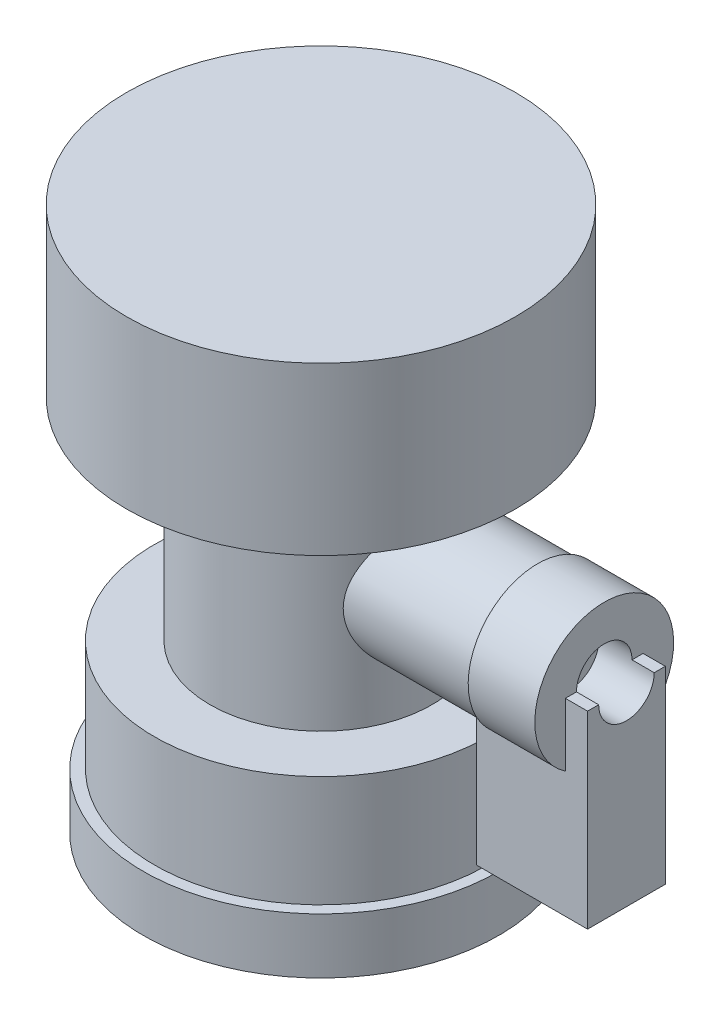
ISO-10303-21;
HEADER;
FILE_DESCRIPTION(('STEP AP214'),'2;1');
FILE_NAME('part.step','',(''),(''),'','','');
FILE_SCHEMA(('AUTOMOTIVE_DESIGN { 1 0 10303 214 1 1 1 1 }'));
ENDSEC;
DATA;
#1=APPLICATION_CONTEXT('core data for automotive mechanical design processes');
#2=APPLICATION_PROTOCOL_DEFINITION('international standard','automotive_design',2000,#1);
#3=PRODUCT_CONTEXT('',#1,'mechanical');
#4=PRODUCT('Part','Part','',(#3));
#5=PRODUCT_RELATED_PRODUCT_CATEGORY('part','',(#4));
#6=PRODUCT_DEFINITION_FORMATION('','',#4);
#7=PRODUCT_DEFINITION_CONTEXT('part definition',#1,'design');
#8=PRODUCT_DEFINITION('design','',#6,#7);
#9=PRODUCT_DEFINITION_SHAPE('','',#8);
#10=(LENGTH_UNIT() NAMED_UNIT(*) SI_UNIT(.MILLI.,.METRE.));
#11=(NAMED_UNIT(*) PLANE_ANGLE_UNIT() SI_UNIT($,.RADIAN.));
#12=(NAMED_UNIT(*) SI_UNIT($,.STERADIAN.) SOLID_ANGLE_UNIT());
#13=UNCERTAINTY_MEASURE_WITH_UNIT(LENGTH_MEASURE(1.E-05),#10,'distance_accuracy_value','');
#14=(GEOMETRIC_REPRESENTATION_CONTEXT(3) GLOBAL_UNCERTAINTY_ASSIGNED_CONTEXT((#13)) GLOBAL_UNIT_ASSIGNED_CONTEXT((#10,
#11,#12)) REPRESENTATION_CONTEXT('',''));
#15=CARTESIAN_POINT('',(0.,0.,0.));
#16=DIRECTION('',(0.,0.,1.));
#17=DIRECTION('',(1.,0.,0.));
#18=AXIS2_PLACEMENT_3D('',#15,#16,#17);
#19=CARTESIAN_POINT('',(0.,10.,0.));
#20=DIRECTION('',(0.,1.,0.));
#21=DIRECTION('',(0.,0.,1.));
#22=AXIS2_PLACEMENT_3D('',#19,#20,#21);
#23=PLANE('',#22);
#24=DIRECTION('',(0.,0.,1.));
#25=VECTOR('',#24,1.);
#26=CARTESIAN_POINT('',(25.5,10.,0.));
#27=LINE('',#26,#25);
#28=CARTESIAN_POINT('',(25.5,10.,-3.5));
#29=VERTEX_POINT('',#28);
#30=CARTESIAN_POINT('',(25.5,10.,-2.5));
#31=VERTEX_POINT('',#30);
#32=EDGE_CURVE('E44',#29,#31,#27,.T.);
#33=ORIENTED_EDGE('',*,*,#32,.T.);
#34=DIRECTION('',(-1.,0.,0.));
#35=VECTOR('',#34,1.);
#36=CARTESIAN_POINT('',(27.501,10.,-2.5));
#37=LINE('',#36,#35);
#38=CARTESIAN_POINT('',(27.5,10.,-2.5));
#39=VERTEX_POINT('',#38);
#40=EDGE_CURVE('E113',#39,#31,#37,.T.);
#41=ORIENTED_EDGE('',*,*,#40,.F.);
#42=DIRECTION('',(0.,0.,-1.));
#43=VECTOR('',#42,1.);
#44=CARTESIAN_POINT('',(27.5,10.,-3.5));
#45=LINE('',#44,#43);
#46=CARTESIAN_POINT('',(27.5,10.,-3.5));
#47=VERTEX_POINT('',#46);
#48=EDGE_CURVE('E232',#39,#47,#45,.T.);
#49=ORIENTED_EDGE('',*,*,#48,.T.);
#50=DIRECTION('',(-1.,0.,0.));
#51=VECTOR('',#50,1.);
#52=CARTESIAN_POINT('',(17.5,10.,-3.5));
#53=LINE('',#52,#51);
#54=EDGE_CURVE('E133',#47,#29,#53,.T.);
#55=ORIENTED_EDGE('',*,*,#54,.T.);
#56=EDGE_LOOP('',(#33,#41,#49,#55));
#57=FACE_BOUND('',#56,.T.);
#58=ADVANCED_FACE('F33',(#57),#23,.T.);
#59=CARTESIAN_POINT('',(27.5,10.,3.5));
#60=VERTEX_POINT('',#59);
#61=CARTESIAN_POINT('',(27.5,10.,2.5));
#62=VERTEX_POINT('',#61);
#63=EDGE_CURVE('E238',#60,#62,#45,.T.);
#64=ORIENTED_EDGE('',*,*,#63,.T.);
#65=DIRECTION('',(-1.,0.,0.));
#66=VECTOR('',#65,1.);
#67=CARTESIAN_POINT('',(27.501,10.,2.5));
#68=LINE('',#67,#66);
#69=CARTESIAN_POINT('',(25.5,10.,2.5));
#70=VERTEX_POINT('',#69);
#71=EDGE_CURVE('E121',#70,#62,#68,.F.);
#72=ORIENTED_EDGE('',*,*,#71,.F.);
#73=CARTESIAN_POINT('',(25.5,10.,3.5));
#74=VERTEX_POINT('',#73);
#75=EDGE_CURVE('E38',#70,#74,#27,.T.);
#76=ORIENTED_EDGE('',*,*,#75,.T.);
#77=DIRECTION('',(1.,0.,0.));
#78=VECTOR('',#77,1.);
#79=CARTESIAN_POINT('',(17.5,10.,3.5));
#80=LINE('',#79,#78);
#81=EDGE_CURVE('E242',#74,#60,#80,.T.);
#82=ORIENTED_EDGE('',*,*,#81,.T.);
#83=EDGE_LOOP('',(#64,#72,#76,#82));
#84=FACE_BOUND('',#83,.T.);
#85=ADVANCED_FACE('F217',(#84),#23,.T.);
#86=CARTESIAN_POINT('',(0.,19.,0.));
#87=DIRECTION('',(0.,-1.,0.));
#88=DIRECTION('',(0.,0.,-1.));
#89=AXIS2_PLACEMENT_3D('',#86,#87,#88);
#90=CYLINDRICAL_SURFACE('',#89,10.);
#91=CARTESIAN_POINT('',(0.,19.,0.));
#92=DIRECTION('',(0.,1.,0.));
#93=DIRECTION('',(0.,0.,1.));
#94=AXIS2_PLACEMENT_3D('',#91,#92,#93);
#95=CIRCLE('',#94,10.);
#96=CARTESIAN_POINT('',(0.,19.,10.));
#97=VERTEX_POINT('',#96);
#98=EDGE_CURVE('E147',#97,#97,#95,.T.);
#99=ORIENTED_EDGE('',*,*,#98,.F.);
#100=EDGE_LOOP('',(#99));
#101=FACE_BOUND('',#100,.T.);
#102=CARTESIAN_POINT('',(0.,0.,0.));
#103=DIRECTION('',(0.,-1.,0.));
#104=DIRECTION('',(0.,0.,-1.));
#105=AXIS2_PLACEMENT_3D('',#102,#103,#104);
#106=CIRCLE('',#105,10.);
#107=CARTESIAN_POINT('',(0.,0.,-10.));
#108=VERTEX_POINT('',#107);
#109=EDGE_CURVE('E303',#108,#108,#106,.T.);
#110=ORIENTED_EDGE('',*,*,#109,.F.);
#111=EDGE_LOOP('',(#110));
#112=FACE_BOUND('',#111,.T.);
#113=CARTESIAN_POINT('',(8.,9.5,6.));
#114=CARTESIAN_POINT('',(7.99999864910224,9.34904564342539,6.00000088162881));
#115=CARTESIAN_POINT('',(8.00428833679091,9.19810168544327,5.99429471853482));
#116=CARTESIAN_POINT('',(8.02124863219104,8.89755593604797,5.97158029595807));
#117=CARTESIAN_POINT('',(8.03391868193524,8.74795405595088,5.95457278892218));
#118=CARTESIAN_POINT('',(8.06710734950176,8.45120189824819,5.90953108490972));
#119=CARTESIAN_POINT('',(8.08763148624475,8.30405342065063,5.88148913384211));
#120=CARTESIAN_POINT('',(8.13569970975774,8.01332190872561,5.81481476566768));
#121=CARTESIAN_POINT('',(8.16324712098121,7.86974059833025,5.77617733255313));
#122=CARTESIAN_POINT('',(8.25448068613034,7.44786055186919,5.64577521853615));
#123=CARTESIAN_POINT('',(8.32706572533657,7.17593079687085,5.53912991890453));
#124=CARTESIAN_POINT('',(8.48743711552897,6.65420402243849,5.29011262993967));
#125=CARTESIAN_POINT('',(8.57522799841511,6.4044136349968,5.1477299838664));
#126=CARTESIAN_POINT('',(8.76915411563735,5.90019208918971,4.81082834240806));
#127=CARTESIAN_POINT('',(8.87621984994956,5.64892775550919,4.61206328098179));
#128=CARTESIAN_POINT('',(9.03582231230531,5.29798768522199,4.28586871155472));
#129=CARTESIAN_POINT('',(9.08889374486005,5.18526425100264,4.17237380323688));
#130=CARTESIAN_POINT('',(9.19358587409139,4.96888581697478,3.93632146632463));
#131=CARTESIAN_POINT('',(9.24520630192437,4.86523249026502,3.81376237338527));
#132=CARTESIAN_POINT('',(9.35129695987745,4.65689755465558,3.54628422867016));
#133=CARTESIAN_POINT('',(9.40546909597467,4.55332360503964,3.40038171956539));
#134=CARTESIAN_POINT('',(9.50910263041578,4.3590094895466,3.09877025729808));
#135=CARTESIAN_POINT('',(9.55856613020448,4.26826358971097,2.94306573077009));
#136=CARTESIAN_POINT('',(9.65137615734108,4.10056137168402,2.62273316271579));
#137=CARTESIAN_POINT('',(9.69472531078955,4.02359912958213,2.45810899446899));
#138=CARTESIAN_POINT('',(9.77400834963342,3.88444025294899,2.12101861519267));
#139=CARTESIAN_POINT('',(9.80994345348834,3.82224119191448,1.94855369844294));
#140=CARTESIAN_POINT('',(9.87021533870989,3.71875934967134,1.61397887310178));
#141=CARTESIAN_POINT('',(9.89533161968247,3.67604710392526,1.45245106417626));
#142=CARTESIAN_POINT('',(9.9378378885394,3.60411446964764,1.12541380029543));
#143=CARTESIAN_POINT('',(9.95522832436573,3.57489329890412,0.95990457676792));
#144=CARTESIAN_POINT('',(9.98175593635162,3.53042968235231,0.626493434249518));
#145=CARTESIAN_POINT('',(9.99089957459115,3.51517629143543,0.4585934935768));
#146=CARTESIAN_POINT('',(10.0006753626941,3.49887074383716,0.121864540254611));
#147=CARTESIAN_POINT('',(10.001308378531,3.49781714229768,-0.0469643761207655));
#148=CARTESIAN_POINT('',(9.99450134908414,3.50916786570373,-0.362947404042192));
#149=CARTESIAN_POINT('',(9.988055423997,3.5199149503719,-0.510186129271388));
#150=CARTESIAN_POINT('',(9.96877939171652,3.55216587391558,-0.803109015744185));
#151=CARTESIAN_POINT('',(9.95594720380779,3.57367321861545,-0.948792654511348));
#152=CARTESIAN_POINT('',(9.92419812325367,3.62716671707077,-1.237487698066));
#153=CARTESIAN_POINT('',(9.90528336854382,3.65914918904125,-1.38050002312209));
#154=CARTESIAN_POINT('',(9.86178063907867,3.73323178375653,-1.66304733568859));
#155=CARTESIAN_POINT('',(9.83719047557732,3.77533581018384,-1.80258095855974));
#156=CARTESIAN_POINT('',(9.78271380551187,3.86946079856275,-2.07805771309281));
#157=CARTESIAN_POINT('',(9.75279971061266,3.92153352961879,-2.213977685514));
#158=CARTESIAN_POINT('',(9.68837327507413,4.03495221750533,-2.48078460487242));
#159=CARTESIAN_POINT('',(9.65385929910513,4.09630147333404,-2.61166974042208));
#160=CARTESIAN_POINT('',(9.54441159722313,4.29348383177023,-2.99582005885702));
#161=CARTESIAN_POINT('',(9.46353385850713,4.44251596520929,-3.24076653470714));
#162=CARTESIAN_POINT('',(9.28151313170845,4.79136512865929,-3.73233294691791));
#163=CARTESIAN_POINT('',(9.1791034522392,4.99512190487958,-3.97565808525399));
#164=CARTESIAN_POINT('',(8.97020600808983,5.43764785523005,-4.42687522495971));
#165=CARTESIAN_POINT('',(8.86371287022899,5.67646441811516,-4.63471843137172));
#166=CARTESIAN_POINT('',(8.70226894648173,6.0727205951449,-4.92797850102128));
#167=CARTESIAN_POINT('',(8.64532309391492,6.21952832884375,-5.02692901573439));
#168=CARTESIAN_POINT('',(8.53500632501968,6.52237939462107,-5.21202996714069));
#169=CARTESIAN_POINT('',(8.48163599732456,6.67842423946547,-5.29817829905958));
#170=CARTESIAN_POINT('',(8.38051460035721,6.99878299774766,-5.45672185252633));
#171=CARTESIAN_POINT('',(8.33275515227876,7.16308404440611,-5.52913768295357));
#172=CARTESIAN_POINT('',(8.24479422007601,7.49927336764095,-5.65946619795369));
#173=CARTESIAN_POINT('',(8.20458976848892,7.67115863238163,-5.71738457983655));
#174=CARTESIAN_POINT('',(8.14249128928077,7.97789327470977,-5.80533969433249));
#175=CARTESIAN_POINT('',(8.11852850235761,8.11137106236812,-5.83872912399161));
#176=CARTESIAN_POINT('',(8.07675184174586,8.38121883532171,-5.89638461996681));
#177=CARTESIAN_POINT('',(8.05893661056294,8.51758817503993,-5.92065270055165));
#178=CARTESIAN_POINT('',(8.03008524390666,8.79225672647759,-5.95972506119773));
#179=CARTESIAN_POINT('',(8.01904259918271,8.93055395407736,-5.97453842890673));
#180=CARTESIAN_POINT('',(8.00411818497226,9.20823671755184,-5.99451827965109));
#181=CARTESIAN_POINT('',(8.00023656735144,9.34762227644411,-5.99968455809828));
#182=CARTESIAN_POINT('',(7.9997841667535,9.62661872216614,-6.00028779640298));
#183=CARTESIAN_POINT('',(8.00322344790999,9.76622965520106,-5.99571136282798));
#184=CARTESIAN_POINT('',(8.01729967500599,10.0444250961031,-5.97687561218467));
#185=CARTESIAN_POINT('',(8.02793665843563,10.1830095986202,-5.96261624468159));
#186=CARTESIAN_POINT('',(8.05602115916921,10.4582396449522,-5.92461644085682));
#187=CARTESIAN_POINT('',(8.0734719572314,10.5948842218242,-5.90087143720405));
#188=CARTESIAN_POINT('',(8.11456896902297,10.865333055754,-5.84422673057314));
#189=CARTESIAN_POINT('',(8.13821771175741,10.9991361292184,-5.81132329025206));
#190=CARTESIAN_POINT('',(8.21726148194672,11.3947012270525,-5.6995591577321));
#191=CARTESIAN_POINT('',(8.28082455624298,11.6512538881402,-5.60755471788689));
#192=CARTESIAN_POINT('',(8.42286190152657,12.1459475353118,-5.39184793321014));
#193=CARTESIAN_POINT('',(8.50134179431292,12.3840815320743,-5.26813363152924));
#194=CARTESIAN_POINT('',(8.68148215419451,12.8809727151561,-4.96667794724345));
#195=CARTESIAN_POINT('',(8.78477096130256,13.1357084330293,-4.78321740719474));
#196=CARTESIAN_POINT('',(8.94082079344033,13.4937195359984,-4.48048054495125));
#197=CARTESIAN_POINT('',(8.99306477859641,13.6091219100944,-4.37488391749691));
#198=CARTESIAN_POINT('',(9.09684476254055,13.8315431826378,-4.15478036587187));
#199=CARTESIAN_POINT('',(9.14838063437488,13.9385605935553,-4.04027186784564));
#200=CARTESIAN_POINT('',(9.25623949495886,14.1570525367295,-3.78725916521219));
#201=CARTESIAN_POINT('',(9.31230980002967,14.2672869117514,-3.6475734482155));
#202=CARTESIAN_POINT('',(9.4205941057635,14.4754893222743,-3.35801798035469));
#203=CARTESIAN_POINT('',(9.47280966312088,14.5734623206243,-3.20815238798259));
#204=CARTESIAN_POINT('',(9.57195369339457,14.756252646494,-2.89897367155155));
#205=CARTESIAN_POINT('',(9.61888335615541,14.8410729362886,-2.73966268600567));
#206=CARTESIAN_POINT('',(9.70609419072746,14.996581661781,-2.41254488128161));
#207=CARTESIAN_POINT('',(9.74637626882177,15.067272024128,-2.24473922428781));
#208=CARTESIAN_POINT('',(9.81640309379021,15.1889418509117,-1.91432616994729));
#209=CARTESIAN_POINT('',(9.84670057004255,15.2409798077395,-1.75222599070734));
#210=CARTESIAN_POINT('',(9.89963820465492,15.3313101560026,-1.42300707093318));
#211=CARTESIAN_POINT('',(9.92227864784977,15.369603058745,-1.25588851732988));
#212=CARTESIAN_POINT('',(9.95919887612942,15.4318014566571,-0.918243836101159));
#213=CARTESIAN_POINT('',(9.97348653527641,15.4557205024728,-0.747721074946205));
#214=CARTESIAN_POINT('',(9.99328101588267,15.4888098960502,-0.40475172803911));
#215=CARTESIAN_POINT('',(9.99878898200748,15.497982166446,-0.232305396028008));
#216=CARTESIAN_POINT('',(10.0007158823898,15.5011926694547,0.0897214575485174));
#217=CARTESIAN_POINT('',(9.99825014101708,15.4970879970575,0.239280869884801));
#218=CARTESIAN_POINT('',(9.9866626014441,15.477749677153,0.537418992701509));
#219=CARTESIAN_POINT('',(9.9775409702157,15.462516308824,0.685997727689192));
#220=CARTESIAN_POINT('',(9.952860128368,15.4211231987912,0.981069174103281));
#221=CARTESIAN_POINT('',(9.93730123061827,15.394963988114,1.1275619865536));
#222=CARTESIAN_POINT('',(9.9001089462329,15.3320493795146,1.41746403997302));
#223=CARTESIAN_POINT('',(9.87847537754162,15.2952936640182,1.56087318838717));
#224=CARTESIAN_POINT('',(9.83001294823669,15.2122913284712,1.84140451131591));
#225=CARTESIAN_POINT('',(9.80327452445085,15.1662091862011,1.97859106269807));
#226=CARTESIAN_POINT('',(9.74493680815261,15.0646663940233,2.24839766655467));
#227=CARTESIAN_POINT('',(9.71333594213896,15.0092027076401,2.38101622374934));
#228=CARTESIAN_POINT('',(9.61215652370218,14.8294860441307,2.77099118695356));
#229=CARTESIAN_POINT('',(9.53616574328078,14.6918483176854,3.02066419261719));
#230=CARTESIAN_POINT('',(9.36373418778332,14.368291940321,3.52109065838496));
#231=CARTESIAN_POINT('',(9.26596893066758,14.1787539976608,3.76901891084855));
#232=CARTESIAN_POINT('',(9.06406113204372,13.7649589992621,4.23160593003124));
#233=CARTESIAN_POINT('',(8.95991160370153,13.5406634801235,4.44622730563912));
#234=CARTESIAN_POINT('',(8.79909217120191,13.1659057724075,4.75306699513205));
#235=CARTESIAN_POINT('',(8.74152637033407,13.0259090644312,4.85784420248668));
#236=CARTESIAN_POINT('',(8.6288705170943,12.7365378320188,5.05524371029082));
#237=CARTESIAN_POINT('',(8.57378107511544,12.5871610170107,5.14786302464979));
#238=CARTESIAN_POINT('',(8.46793169532304,12.2796928376403,5.32018482809803));
#239=CARTESIAN_POINT('',(8.41717121173722,12.121602575973,5.39988894661096));
#240=CARTESIAN_POINT('',(8.32192914439253,11.7974909141224,5.54554477107688));
#241=CARTESIAN_POINT('',(8.27744334698199,11.6314749375491,5.61150572034596));
#242=CARTESIAN_POINT('',(8.20010888837648,11.3067891175005,5.72385081019425));
#243=CARTESIAN_POINT('',(8.16659343417489,11.148689453262,5.77142045549499));
#244=CARTESIAN_POINT('',(8.10789739053264,10.8277264475687,5.85359345466856));
#245=CARTESIAN_POINT('',(8.08271137293097,10.6648662840819,5.88820525491189));
#246=CARTESIAN_POINT('',(8.04190038323599,10.3359096628891,5.94382312963065));
#247=CARTESIAN_POINT('',(8.02626034265942,10.1698187349462,5.96485065019987));
#248=CARTESIAN_POINT('',(8.00531155242235,9.83581409516838,5.99293771613585));
#249=CARTESIAN_POINT('',(8.00000150255065,9.66790061540942,5.99999901939882));
#250=CARTESIAN_POINT('',(8.,9.5,6.));
#251=B_SPLINE_CURVE_WITH_KNOTS('',3,(#113,#114,#115,#116,#117,#118,#119,#120,#121,#122,#123,
#124,#125,#126,#127,#128,#129,#130,#131,#132,#133,#134,#135,#136,#137,#138,#139,#140,#141,#142,
#143,#144,#145,#146,#147,#148,#149,#150,#151,#152,#153,#154,#155,#156,#157,#158,#159,#160,#161,
#162,#163,#164,#165,#166,#167,#168,#169,#170,#171,#172,#173,#174,#175,#176,#177,#178,#179,#180,
#181,#182,#183,#184,#185,#186,#187,#188,#189,#190,#191,#192,#193,#194,#195,#196,#197,#198,#199,
#200,#201,#202,#203,#204,#205,#206,#207,#208,#209,#210,#211,#212,#213,#214,#215,#216,#217,#218,
#219,#220,#221,#222,#223,#224,#225,#226,#227,#228,#229,#230,#231,#232,#233,#234,#235,#236,#237,
#238,#239,#240,#241,#242,#243,#244,#245,#246,#247,#248,#249,#250),.UNSPECIFIED.,.T.,.F.,(4,2,2,
2,2,2,2,2,2,2,2,2,2,2,2,2,2,2,2,2,2,2,2,2,2,2,2,2,2,2,2,2,2,2,2,2,2,2,2,2,2,2,2,2,2,2,2,2,2,2,2,
2,2,2,2,2,2,2,2,2,2,2,2,2,2,2,2,2,4),(0.,0.452678131953081,0.905326127479812,1.35829277610849,
1.81147423500294,2.71030243772275,3.60939898666924,4.61842643340733,5.12364477538536,
5.62895611582987,6.18907007252825,6.7489328690842,7.30855446857233,7.86808402384475,
8.37422610792176,8.88033884221518,9.38605464793527,9.89171899563242,10.3345024918992,
10.777430346487,11.2202026880973,11.6631460729563,12.1084553973056,12.5539234605076,
13.4442631938077,14.4409496612456,15.4389959252679,15.9963343187221,16.5537642416308,
17.1103508709196,17.6667184242241,18.0852817260551,18.5037525421122,18.9218205257131,
19.3398973752831,19.7585493316179,20.1772034685705,20.5960594308092,21.0150865695569,
21.8512278120472,22.6876848036402,23.6749363767384,24.1693355999537,24.6638223341296,
25.2228243825863,25.7815994355499,26.3402484569055,26.8988212531045,27.4168373395204,
27.9348341540781,28.4523418690018,28.9697821075672,29.4181370808688,29.8664808069716,
30.3148027448461,30.7631381201982,31.2041651922951,31.6453352834275,32.5270550916606,
33.5044950178567,34.4830244255554,35.0347612934609,35.5866334204804,36.138435867192,
36.6898659785695,37.1945532695295,37.6989110127382,38.2024705458659,38.7059666930588),.UNSPECIFIED.);
#252=CARTESIAN_POINT('',(8.,9.5,6.));
#253=VERTEX_POINT('',#252);
#254=EDGE_CURVE('E142',#253,#253,#251,.T.);
#255=ORIENTED_EDGE('',*,*,#254,.F.);
#256=EDGE_LOOP('',(#255));
#257=FACE_BOUND('',#256,.T.);
#258=ADVANCED_FACE('F35',(#101,#112,#257),#90,.T.);
#259=CARTESIAN_POINT('',(19.5,9.5,0.));
#260=DIRECTION('',(-1.,0.,0.));
#261=DIRECTION('',(0.,0.,1.));
#262=AXIS2_PLACEMENT_3D('',#259,#260,#261);
#263=CYLINDRICAL_SURFACE('',#262,6.);
#264=CARTESIAN_POINT('',(17.5,9.5,0.));
#265=DIRECTION('',(-1.,0.,0.));
#266=DIRECTION('',(0.,0.,1.));
#267=AXIS2_PLACEMENT_3D('',#264,#265,#266);
#268=CIRCLE('',#267,6.);
#269=CARTESIAN_POINT('',(17.5,4.62660282759552,-3.5));
#270=VERTEX_POINT('',#269);
#271=CARTESIAN_POINT('',(17.5,4.62660282759552,3.5));
#272=VERTEX_POINT('',#271);
#273=EDGE_CURVE('E11',#270,#272,#268,.T.);
#274=ORIENTED_EDGE('',*,*,#273,.T.);
#275=DIRECTION('',(-1.,0.,0.));
#276=VECTOR('',#275,1.);
#277=CARTESIAN_POINT('',(19.5,4.62660282759552,3.5));
#278=LINE('',#277,#276);
#279=CARTESIAN_POINT('',(19.5,4.62660282759552,3.5));
#280=VERTEX_POINT('',#279);
#281=EDGE_CURVE('E276',#272,#280,#278,.F.);
#282=ORIENTED_EDGE('',*,*,#281,.T.);
#283=CARTESIAN_POINT('',(19.5,9.5,0.));
#284=DIRECTION('',(1.,0.,0.));
#285=DIRECTION('',(0.,0.,-1.));
#286=AXIS2_PLACEMENT_3D('',#283,#284,#285);
#287=CIRCLE('',#286,6.);
#288=CARTESIAN_POINT('',(19.5,4.62660282759552,-3.5));
#289=VERTEX_POINT('',#288);
#290=EDGE_CURVE('E307',#289,#280,#287,.T.);
#291=ORIENTED_EDGE('',*,*,#290,.F.);
#292=DIRECTION('',(-1.,0.,0.));
#293=VECTOR('',#292,1.);
#294=CARTESIAN_POINT('',(19.5,4.62660282759552,-3.5));
#295=LINE('',#294,#293);
#296=EDGE_CURVE('E60',#289,#270,#295,.T.);
#297=ORIENTED_EDGE('',*,*,#296,.T.);
#298=EDGE_LOOP('',(#274,#282,#291,#297));
#299=FACE_BOUND('',#298,.T.);
#300=ORIENTED_EDGE('',*,*,#254,.T.);
#301=EDGE_LOOP('',(#300));
#302=FACE_BOUND('',#301,.T.);
#303=ADVANCED_FACE('F149',(#299,#302),#263,.T.);
#304=CARTESIAN_POINT('',(0.,-10.,0.));
#305=DIRECTION('',(0.,1.,0.));
#306=DIRECTION('',(0.,0.,1.));
#307=AXIS2_PLACEMENT_3D('',#304,#305,#306);
#308=CYLINDRICAL_SURFACE('',#307,15.);
#309=CARTESIAN_POINT('',(0.,-10.,0.));
#310=DIRECTION('',(0.,-1.,0.));
#311=DIRECTION('',(0.,0.,-1.));
#312=AXIS2_PLACEMENT_3D('',#309,#310,#311);
#313=CIRCLE('',#312,15.);
#314=CARTESIAN_POINT('',(0.,-10.,-15.));
#315=VERTEX_POINT('',#314);
#316=EDGE_CURVE('E300',#315,#315,#313,.T.);
#317=ORIENTED_EDGE('',*,*,#316,.F.);
#318=EDGE_LOOP('',(#317));
#319=FACE_BOUND('',#318,.T.);
#320=CARTESIAN_POINT('',(0.,0.,0.));
#321=DIRECTION('',(0.,-1.,0.));
#322=DIRECTION('',(0.,0.,-1.));
#323=AXIS2_PLACEMENT_3D('',#320,#321,#322);
#324=CIRCLE('',#323,15.);
#325=CARTESIAN_POINT('',(0.,0.,-15.));
#326=VERTEX_POINT('',#325);
#327=EDGE_CURVE('E297',#326,#326,#324,.T.);
#328=ORIENTED_EDGE('',*,*,#327,.T.);
#329=EDGE_LOOP('',(#328));
#330=FACE_BOUND('',#329,.T.);
#331=ADVANCED_FACE('F153',(#319,#330),#308,.T.);
#332=CARTESIAN_POINT('',(0.,0.,0.));
#333=DIRECTION('',(0.,-1.,0.));
#334=DIRECTION('',(0.,0.,-1.));
#335=AXIS2_PLACEMENT_3D('',#332,#333,#334);
#336=PLANE('',#335);
#337=ORIENTED_EDGE('',*,*,#109,.T.);
#338=EDGE_LOOP('',(#337));
#339=FACE_BOUND('',#338,.T.);
#340=ORIENTED_EDGE('',*,*,#327,.F.);
#341=EDGE_LOOP('',(#340));
#342=FACE_BOUND('',#341,.T.);
#343=ADVANCED_FACE('F157',(#339,#342),#336,.F.);
#344=CARTESIAN_POINT('',(0.,-15.,0.));
#345=DIRECTION('',(0.,1.,0.));
#346=DIRECTION('',(0.,0.,1.));
#347=AXIS2_PLACEMENT_3D('',#344,#345,#346);
#348=CYLINDRICAL_SURFACE('',#347,16.);
#349=CARTESIAN_POINT('',(0.,-15.,0.));
#350=DIRECTION('',(0.,-1.,0.));
#351=DIRECTION('',(0.,0.,-1.));
#352=AXIS2_PLACEMENT_3D('',#349,#350,#351);
#353=CIRCLE('',#352,16.);
#354=CARTESIAN_POINT('',(0.,-15.,-16.));
#355=VERTEX_POINT('',#354);
#356=EDGE_CURVE('E294',#355,#355,#353,.T.);
#357=ORIENTED_EDGE('',*,*,#356,.F.);
#358=EDGE_LOOP('',(#357));
#359=FACE_BOUND('',#358,.T.);
#360=CARTESIAN_POINT('',(0.,-10.,0.));
#361=DIRECTION('',(0.,-1.,0.));
#362=DIRECTION('',(0.,0.,-1.));
#363=AXIS2_PLACEMENT_3D('',#360,#361,#362);
#364=CIRCLE('',#363,16.);
#365=CARTESIAN_POINT('',(0.,-10.,-16.));
#366=VERTEX_POINT('',#365);
#367=EDGE_CURVE('E291',#366,#366,#364,.T.);
#368=ORIENTED_EDGE('',*,*,#367,.T.);
#369=EDGE_LOOP('',(#368));
#370=FACE_BOUND('',#369,.T.);
#371=ADVANCED_FACE('F161',(#359,#370),#348,.T.);
#372=CARTESIAN_POINT('',(0.,-15.,0.));
#373=DIRECTION('',(0.,-1.,0.));
#374=DIRECTION('',(0.,0.,-1.));
#375=AXIS2_PLACEMENT_3D('',#372,#373,#374);
#376=PLANE('',#375);
#377=ORIENTED_EDGE('',*,*,#356,.T.);
#378=EDGE_LOOP('',(#377));
#379=FACE_BOUND('',#378,.T.);
#380=ADVANCED_FACE('F165',(#379),#376,.T.);
#381=CARTESIAN_POINT('',(0.,-10.,0.));
#382=DIRECTION('',(0.,-1.,0.));
#383=DIRECTION('',(0.,0.,-1.));
#384=AXIS2_PLACEMENT_3D('',#381,#382,#383);
#385=PLANE('',#384);
#386=ORIENTED_EDGE('',*,*,#316,.T.);
#387=EDGE_LOOP('',(#386));
#388=FACE_BOUND('',#387,.T.);
#389=ORIENTED_EDGE('',*,*,#367,.F.);
#390=EDGE_LOOP('',(#389));
#391=FACE_BOUND('',#390,.T.);
#392=ADVANCED_FACE('F167',(#388,#391),#385,.F.);
#393=CARTESIAN_POINT('',(0.,34.,0.));
#394=DIRECTION('',(0.,-1.,0.));
#395=DIRECTION('',(0.,0.,-1.));
#396=AXIS2_PLACEMENT_3D('',#393,#394,#395);
#397=CYLINDRICAL_SURFACE('',#396,17.5);
#398=CARTESIAN_POINT('',(0.,34.,0.));
#399=DIRECTION('',(0.,1.,0.));
#400=DIRECTION('',(0.,0.,1.));
#401=AXIS2_PLACEMENT_3D('',#398,#399,#400);
#402=CIRCLE('',#401,17.5);
#403=CARTESIAN_POINT('',(0.,34.,17.5));
#404=VERTEX_POINT('',#403);
#405=EDGE_CURVE('E288',#404,#404,#402,.T.);
#406=ORIENTED_EDGE('',*,*,#405,.F.);
#407=EDGE_LOOP('',(#406));
#408=FACE_BOUND('',#407,.T.);
#409=CARTESIAN_POINT('',(0.,19.,0.));
#410=DIRECTION('',(0.,1.,0.));
#411=DIRECTION('',(0.,0.,1.));
#412=AXIS2_PLACEMENT_3D('',#409,#410,#411);
#413=CIRCLE('',#412,17.5);
#414=CARTESIAN_POINT('',(0.,19.,17.5));
#415=VERTEX_POINT('',#414);
#416=EDGE_CURVE('E285',#415,#415,#413,.T.);
#417=ORIENTED_EDGE('',*,*,#416,.T.);
#418=EDGE_LOOP('',(#417));
#419=FACE_BOUND('',#418,.T.);
#420=ADVANCED_FACE('F170',(#408,#419),#397,.T.);
#421=CARTESIAN_POINT('',(0.,34.,0.));
#422=DIRECTION('',(0.,1.,0.));
#423=DIRECTION('',(0.,0.,1.));
#424=AXIS2_PLACEMENT_3D('',#421,#422,#423);
#425=PLANE('',#424);
#426=ORIENTED_EDGE('',*,*,#405,.T.);
#427=EDGE_LOOP('',(#426));
#428=FACE_BOUND('',#427,.T.);
#429=ADVANCED_FACE('F177',(#428),#425,.T.);
#430=CARTESIAN_POINT('',(0.,19.,0.));
#431=DIRECTION('',(0.,1.,0.));
#432=DIRECTION('',(0.,0.,1.));
#433=AXIS2_PLACEMENT_3D('',#430,#431,#432);
#434=PLANE('',#433);
#435=ORIENTED_EDGE('',*,*,#98,.T.);
#436=EDGE_LOOP('',(#435));
#437=FACE_BOUND('',#436,.T.);
#438=ORIENTED_EDGE('',*,*,#416,.F.);
#439=EDGE_LOOP('',(#438));
#440=FACE_BOUND('',#439,.T.);
#441=ADVANCED_FACE('F179',(#437,#440),#434,.F.);
#442=CARTESIAN_POINT('',(25.5,9.5,0.));
#443=DIRECTION('',(-1.,0.,0.));
#444=DIRECTION('',(0.,0.,1.));
#445=AXIS2_PLACEMENT_3D('',#442,#443,#444);
#446=CYLINDRICAL_SURFACE('',#445,6.25);
#447=CARTESIAN_POINT('',(19.5,9.5,0.));
#448=DIRECTION('',(1.,0.,0.));
#449=DIRECTION('',(0.,0.,-1.));
#450=AXIS2_PLACEMENT_3D('',#447,#448,#449);
#451=CIRCLE('',#450,6.25);
#452=CARTESIAN_POINT('',(19.5,4.321921205698,-3.5));
#453=VERTEX_POINT('',#452);
#454=CARTESIAN_POINT('',(19.5,4.321921205698,3.5));
#455=VERTEX_POINT('',#454);
#456=EDGE_CURVE('E281',#453,#455,#451,.T.);
#457=ORIENTED_EDGE('',*,*,#456,.T.);
#458=DIRECTION('',(-1.,0.,0.));
#459=VECTOR('',#458,1.);
#460=CARTESIAN_POINT('',(25.5,4.321921205698,3.5));
#461=LINE('',#460,#459);
#462=CARTESIAN_POINT('',(25.5,4.321921205698,3.5));
#463=VERTEX_POINT('',#462);
#464=EDGE_CURVE('E273',#455,#463,#461,.F.);
#465=ORIENTED_EDGE('',*,*,#464,.T.);
#466=CARTESIAN_POINT('',(25.5,9.5,0.));
#467=DIRECTION('',(1.,0.,0.));
#468=DIRECTION('',(0.,0.,-1.));
#469=AXIS2_PLACEMENT_3D('',#466,#467,#468);
#470=CIRCLE('',#469,6.25);
#471=CARTESIAN_POINT('',(25.5,4.321921205698,-3.5));
#472=VERTEX_POINT('',#471);
#473=EDGE_CURVE('E282',#472,#463,#470,.T.);
#474=ORIENTED_EDGE('',*,*,#473,.F.);
#475=DIRECTION('',(-1.,0.,0.));
#476=VECTOR('',#475,1.);
#477=CARTESIAN_POINT('',(25.5,4.321921205698,-3.5));
#478=LINE('',#477,#476);
#479=EDGE_CURVE('E260',#472,#453,#478,.T.);
#480=ORIENTED_EDGE('',*,*,#479,.T.);
#481=EDGE_LOOP('',(#457,#465,#474,#480));
#482=FACE_BOUND('',#481,.T.);
#483=ADVANCED_FACE('F182',(#482),#446,.T.);
#484=CARTESIAN_POINT('',(25.5,9.5,0.));
#485=DIRECTION('',(1.,0.,0.));
#486=DIRECTION('',(0.,0.,-1.));
#487=AXIS2_PLACEMENT_3D('',#484,#485,#486);
#488=PLANE('',#487);
#489=ORIENTED_EDGE('',*,*,#75,.F.);
#490=CARTESIAN_POINT('',(25.5,10.,0.));
#491=DIRECTION('',(1.,0.,0.));
#492=DIRECTION('',(0.,0.,-1.));
#493=AXIS2_PLACEMENT_3D('',#490,#491,#492);
#494=CIRCLE('',#493,2.5);
#495=EDGE_CURVE('E52',#31,#70,#494,.T.);
#496=ORIENTED_EDGE('',*,*,#495,.F.);
#497=ORIENTED_EDGE('',*,*,#32,.F.);
#498=DIRECTION('',(0.,1.,0.));
#499=VECTOR('',#498,1.);
#500=CARTESIAN_POINT('',(25.5,9.5,-3.5));
#501=LINE('',#500,#499);
#502=EDGE_CURVE('E271',#472,#29,#501,.T.);
#503=ORIENTED_EDGE('',*,*,#502,.F.);
#504=ORIENTED_EDGE('',*,*,#473,.T.);
#505=DIRECTION('',(0.,-1.,0.));
#506=VECTOR('',#505,1.);
#507=CARTESIAN_POINT('',(25.5,9.5,3.5));
#508=LINE('',#507,#506);
#509=EDGE_CURVE('E279',#74,#463,#508,.T.);
#510=ORIENTED_EDGE('',*,*,#509,.F.);
#511=EDGE_LOOP('',(#489,#496,#497,#503,#504,#510));
#512=FACE_BOUND('',#511,.T.);
#513=ADVANCED_FACE('F126',(#512),#488,.T.);
#514=CARTESIAN_POINT('',(19.5,9.5,0.));
#515=DIRECTION('',(1.,0.,0.));
#516=DIRECTION('',(0.,0.,-1.));
#517=AXIS2_PLACEMENT_3D('',#514,#515,#516);
#518=PLANE('',#517);
#519=ORIENTED_EDGE('',*,*,#290,.T.);
#520=DIRECTION('',(0.,-1.,0.));
#521=VECTOR('',#520,1.);
#522=CARTESIAN_POINT('',(19.5,9.5,3.5));
#523=LINE('',#522,#521);
#524=EDGE_CURVE('E134',#280,#455,#523,.T.);
#525=ORIENTED_EDGE('',*,*,#524,.T.);
#526=ORIENTED_EDGE('',*,*,#456,.F.);
#527=DIRECTION('',(0.,1.,0.));
#528=VECTOR('',#527,1.);
#529=CARTESIAN_POINT('',(19.5,9.5,-3.5));
#530=LINE('',#529,#528);
#531=EDGE_CURVE('E140',#453,#289,#530,.T.);
#532=ORIENTED_EDGE('',*,*,#531,.T.);
#533=EDGE_LOOP('',(#519,#525,#526,#532));
#534=FACE_BOUND('',#533,.T.);
#535=ADVANCED_FACE('F190',(#534),#518,.F.);
#536=CARTESIAN_POINT('',(27.5,-7.,-3.5));
#537=DIRECTION('',(1.,0.,0.));
#538=DIRECTION('',(0.,0.,-1.));
#539=AXIS2_PLACEMENT_3D('',#536,#537,#538);
#540=PLANE('',#539);
#541=ORIENTED_EDGE('',*,*,#48,.F.);
#542=CARTESIAN_POINT('',(27.5,10.,0.));
#543=DIRECTION('',(1.,0.,0.));
#544=DIRECTION('',(0.,0.,-1.));
#545=AXIS2_PLACEMENT_3D('',#542,#543,#544);
#546=CIRCLE('',#545,2.5);
#547=EDGE_CURVE('E117',#62,#39,#546,.T.);
#548=ORIENTED_EDGE('',*,*,#547,.F.);
#549=ORIENTED_EDGE('',*,*,#63,.F.);
#550=DIRECTION('',(0.,1.,0.));
#551=VECTOR('',#550,1.);
#552=CARTESIAN_POINT('',(27.5,-7.,3.5));
#553=LINE('',#552,#551);
#554=CARTESIAN_POINT('',(27.5,-7.,3.5));
#555=VERTEX_POINT('',#554);
#556=EDGE_CURVE('E257',#555,#60,#553,.T.);
#557=ORIENTED_EDGE('',*,*,#556,.F.);
#558=DIRECTION('',(0.,0.,-1.));
#559=VECTOR('',#558,1.);
#560=CARTESIAN_POINT('',(27.5,-7.,-3.5));
#561=LINE('',#560,#559);
#562=CARTESIAN_POINT('',(27.5,-7.,-3.5));
#563=VERTEX_POINT('',#562);
#564=EDGE_CURVE('E244',#555,#563,#561,.T.);
#565=ORIENTED_EDGE('',*,*,#564,.T.);
#566=DIRECTION('',(0.,1.,0.));
#567=VECTOR('',#566,1.);
#568=CARTESIAN_POINT('',(27.5,-7.,-3.5));
#569=LINE('',#568,#567);
#570=EDGE_CURVE('E256',#563,#47,#569,.T.);
#571=ORIENTED_EDGE('',*,*,#570,.T.);
#572=EDGE_LOOP('',(#541,#548,#549,#557,#565,#571));
#573=FACE_BOUND('',#572,.T.);
#574=ADVANCED_FACE('F193',(#573),#540,.T.);
#575=CARTESIAN_POINT('',(17.5,-7.,3.5));
#576=DIRECTION('',(0.,0.,1.));
#577=DIRECTION('',(1.,0.,0.));
#578=AXIS2_PLACEMENT_3D('',#575,#576,#577);
#579=PLANE('',#578);
#580=ORIENTED_EDGE('',*,*,#81,.F.);
#581=ORIENTED_EDGE('',*,*,#509,.T.);
#582=ORIENTED_EDGE('',*,*,#464,.F.);
#583=ORIENTED_EDGE('',*,*,#524,.F.);
#584=ORIENTED_EDGE('',*,*,#281,.F.);
#585=DIRECTION('',(0.,1.,0.));
#586=VECTOR('',#585,1.);
#587=CARTESIAN_POINT('',(17.5,-7.,3.5));
#588=LINE('',#587,#586);
#589=CARTESIAN_POINT('',(17.5,-7.,3.5));
#590=VERTEX_POINT('',#589);
#591=EDGE_CURVE('E261',#590,#272,#588,.T.);
#592=ORIENTED_EDGE('',*,*,#591,.F.);
#593=DIRECTION('',(1.,0.,0.));
#594=VECTOR('',#593,1.);
#595=CARTESIAN_POINT('',(17.5,-7.,3.5));
#596=LINE('',#595,#594);
#597=EDGE_CURVE('E253',#590,#555,#596,.T.);
#598=ORIENTED_EDGE('',*,*,#597,.T.);
#599=ORIENTED_EDGE('',*,*,#556,.T.);
#600=EDGE_LOOP('',(#580,#581,#582,#583,#584,#592,#598,#599));
#601=FACE_BOUND('',#600,.T.);
#602=ADVANCED_FACE('F199',(#601),#579,.T.);
#603=CARTESIAN_POINT('',(17.5,-7.,-3.5));
#604=DIRECTION('',(-1.,0.,0.));
#605=DIRECTION('',(0.,0.,1.));
#606=AXIS2_PLACEMENT_3D('',#603,#604,#605);
#607=PLANE('',#606);
#608=ORIENTED_EDGE('',*,*,#273,.F.);
#609=DIRECTION('',(0.,1.,0.));
#610=VECTOR('',#609,1.);
#611=CARTESIAN_POINT('',(17.5,-7.,-3.5));
#612=LINE('',#611,#610);
#613=CARTESIAN_POINT('',(17.5,-7.,-3.5));
#614=VERTEX_POINT('',#613);
#615=EDGE_CURVE('E264',#614,#270,#612,.T.);
#616=ORIENTED_EDGE('',*,*,#615,.F.);
#617=DIRECTION('',(0.,0.,1.));
#618=VECTOR('',#617,1.);
#619=CARTESIAN_POINT('',(17.5,-7.,-3.5));
#620=LINE('',#619,#618);
#621=EDGE_CURVE('E250',#614,#590,#620,.T.);
#622=ORIENTED_EDGE('',*,*,#621,.T.);
#623=ORIENTED_EDGE('',*,*,#591,.T.);
#624=EDGE_LOOP('',(#608,#616,#622,#623));
#625=FACE_BOUND('',#624,.T.);
#626=ADVANCED_FACE('F205',(#625),#607,.T.);
#627=CARTESIAN_POINT('',(17.5,-7.,-3.5));
#628=DIRECTION('',(0.,0.,-1.));
#629=DIRECTION('',(-1.,0.,0.));
#630=AXIS2_PLACEMENT_3D('',#627,#628,#629);
#631=PLANE('',#630);
#632=ORIENTED_EDGE('',*,*,#479,.F.);
#633=ORIENTED_EDGE('',*,*,#502,.T.);
#634=ORIENTED_EDGE('',*,*,#54,.F.);
#635=ORIENTED_EDGE('',*,*,#570,.F.);
#636=DIRECTION('',(-1.,0.,0.));
#637=VECTOR('',#636,1.);
#638=CARTESIAN_POINT('',(17.5,-7.,-3.5));
#639=LINE('',#638,#637);
#640=EDGE_CURVE('E247',#563,#614,#639,.T.);
#641=ORIENTED_EDGE('',*,*,#640,.T.);
#642=ORIENTED_EDGE('',*,*,#615,.T.);
#643=ORIENTED_EDGE('',*,*,#296,.F.);
#644=ORIENTED_EDGE('',*,*,#531,.F.);
#645=EDGE_LOOP('',(#632,#633,#634,#635,#641,#642,#643,#644));
#646=FACE_BOUND('',#645,.T.);
#647=ADVANCED_FACE('F201',(#646),#631,.T.);
#648=CARTESIAN_POINT('',(0.,-7.,0.));
#649=DIRECTION('',(0.,1.,0.));
#650=DIRECTION('',(0.,0.,1.));
#651=AXIS2_PLACEMENT_3D('',#648,#649,#650);
#652=PLANE('',#651);
#653=ORIENTED_EDGE('',*,*,#564,.F.);
#654=ORIENTED_EDGE('',*,*,#597,.F.);
#655=ORIENTED_EDGE('',*,*,#621,.F.);
#656=ORIENTED_EDGE('',*,*,#640,.F.);
#657=EDGE_LOOP('',(#653,#654,#655,#656));
#658=FACE_BOUND('',#657,.T.);
#659=ADVANCED_FACE('F204',(#658),#652,.F.);
#660=CARTESIAN_POINT('',(27.501,10.,0.));
#661=DIRECTION('',(-1.,0.,0.));
#662=DIRECTION('',(0.,0.,1.));
#663=AXIS2_PLACEMENT_3D('',#660,#661,#662);
#664=CYLINDRICAL_SURFACE('',#663,2.5);
#665=ORIENTED_EDGE('',*,*,#40,.T.);
#666=ORIENTED_EDGE('',*,*,#495,.T.);
#667=ORIENTED_EDGE('',*,*,#71,.T.);
#668=ORIENTED_EDGE('',*,*,#547,.T.);
#669=EDGE_LOOP('',(#665,#666,#667,#668));
#670=FACE_BOUND('',#669,.T.);
#671=CARTESIAN_POINT('',(22.5,10.,0.));
#672=DIRECTION('',(1.,0.,0.));
#673=DIRECTION('',(0.,0.,-1.));
#674=AXIS2_PLACEMENT_3D('',#671,#672,#673);
#675=CIRCLE('',#674,2.5);
#676=CARTESIAN_POINT('',(22.5,10.,-2.5));
#677=VERTEX_POINT('',#676);
#678=EDGE_CURVE('E129',#677,#677,#675,.T.);
#679=ORIENTED_EDGE('',*,*,#678,.F.);
#680=EDGE_LOOP('',(#679));
#681=FACE_BOUND('',#680,.T.);
#682=ADVANCED_FACE('F114',(#670,#681),#664,.F.);
#683=CARTESIAN_POINT('',(22.5,10.,0.));
#684=DIRECTION('',(1.,0.,0.));
#685=DIRECTION('',(0.,0.,-1.));
#686=AXIS2_PLACEMENT_3D('',#683,#684,#685);
#687=PLANE('',#686);
#688=ORIENTED_EDGE('',*,*,#678,.T.);
#689=EDGE_LOOP('',(#688));
#690=FACE_BOUND('',#689,.T.);
#691=ADVANCED_FACE('F220',(#690),#687,.T.);
#692=CLOSED_SHELL('',(#58,#85,#258,#303,#331,#343,#371,#380,#392,#420,#429,#441,#483,#513,#535,
#574,#602,#626,#647,#659,#682,#691));
#693=MANIFOLD_SOLID_BREP('B2',#692);
#694=ADVANCED_BREP_SHAPE_REPRESENTATION('',(#18,#693),#14);
#695=SHAPE_DEFINITION_REPRESENTATION(#9,#694);
ENDSEC;
END-ISO-10303-21;
